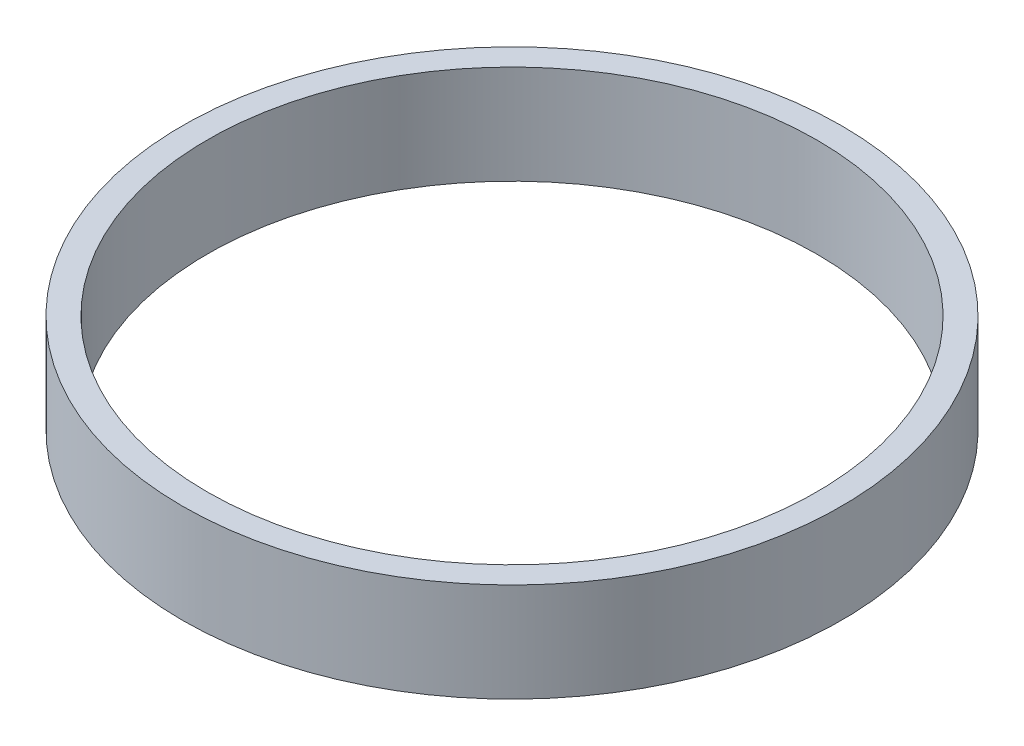
ISO-10303-21;
HEADER;
FILE_DESCRIPTION(('STEP AP214'),'2;1');
FILE_NAME('part.step','',(''),(''),'','','');
FILE_SCHEMA(('AUTOMOTIVE_DESIGN { 1 0 10303 214 1 1 1 1 }'));
ENDSEC;
DATA;
#1=APPLICATION_CONTEXT('core data for automotive mechanical design processes');
#2=APPLICATION_PROTOCOL_DEFINITION('international standard','automotive_design',2000,#1);
#3=PRODUCT_CONTEXT('',#1,'mechanical');
#4=PRODUCT('Part','Part','',(#3));
#5=PRODUCT_RELATED_PRODUCT_CATEGORY('part','',(#4));
#6=PRODUCT_DEFINITION_FORMATION('','',#4);
#7=PRODUCT_DEFINITION_CONTEXT('part definition',#1,'design');
#8=PRODUCT_DEFINITION('design','',#6,#7);
#9=PRODUCT_DEFINITION_SHAPE('','',#8);
#10=(LENGTH_UNIT() NAMED_UNIT(*) SI_UNIT(.MILLI.,.METRE.));
#11=(NAMED_UNIT(*) PLANE_ANGLE_UNIT() SI_UNIT($,.RADIAN.));
#12=(NAMED_UNIT(*) SI_UNIT($,.STERADIAN.) SOLID_ANGLE_UNIT());
#13=UNCERTAINTY_MEASURE_WITH_UNIT(LENGTH_MEASURE(1.E-05),#10,'distance_accuracy_value','');
#14=(GEOMETRIC_REPRESENTATION_CONTEXT(3) GLOBAL_UNCERTAINTY_ASSIGNED_CONTEXT((#13)) GLOBAL_UNIT_ASSIGNED_CONTEXT((#10,
#11,#12)) REPRESENTATION_CONTEXT('',''));
#15=CARTESIAN_POINT('',(0.,0.,0.));
#16=DIRECTION('',(0.,0.,1.));
#17=DIRECTION('',(1.,0.,0.));
#18=AXIS2_PLACEMENT_3D('',#15,#16,#17);
#19=CARTESIAN_POINT('',(0.,6.,0.));
#20=DIRECTION('',(0.,-1.,0.));
#21=DIRECTION('',(0.,0.,-1.));
#22=AXIS2_PLACEMENT_3D('',#19,#20,#21);
#23=CYLINDRICAL_SURFACE('',#22,20.);
#24=CARTESIAN_POINT('',(0.,6.,0.));
#25=DIRECTION('',(0.,1.,0.));
#26=DIRECTION('',(0.,0.,1.));
#27=AXIS2_PLACEMENT_3D('',#24,#25,#26);
#28=CIRCLE('',#27,20.);
#29=CARTESIAN_POINT('',(0.,6.,20.));
#30=VERTEX_POINT('',#29);
#31=EDGE_CURVE('E10',#30,#30,#28,.T.);
#32=ORIENTED_EDGE('',*,*,#31,.F.);
#33=EDGE_LOOP('',(#32));
#34=FACE_BOUND('',#33,.T.);
#35=CARTESIAN_POINT('',(0.,0.,0.));
#36=DIRECTION('',(0.,1.,0.));
#37=DIRECTION('',(0.,0.,1.));
#38=AXIS2_PLACEMENT_3D('',#35,#36,#37);
#39=CIRCLE('',#38,20.);
#40=CARTESIAN_POINT('',(0.,0.,20.));
#41=VERTEX_POINT('',#40);
#42=EDGE_CURVE('E40',#41,#41,#39,.T.);
#43=ORIENTED_EDGE('',*,*,#42,.T.);
#44=EDGE_LOOP('',(#43));
#45=FACE_BOUND('',#44,.T.);
#46=ADVANCED_FACE('F37',(#34,#45),#23,.T.);
#47=CARTESIAN_POINT('',(0.,6.,0.));
#48=DIRECTION('',(0.,1.,0.));
#49=DIRECTION('',(0.,0.,1.));
#50=AXIS2_PLACEMENT_3D('',#47,#48,#49);
#51=PLANE('',#50);
#52=CARTESIAN_POINT('',(0.,6.,0.));
#53=DIRECTION('',(0.,1.,0.));
#54=DIRECTION('',(0.,0.,1.));
#55=AXIS2_PLACEMENT_3D('',#52,#53,#54);
#56=CIRCLE('',#55,18.5);
#57=CARTESIAN_POINT('',(0.,6.,18.5));
#58=VERTEX_POINT('',#57);
#59=EDGE_CURVE('E51',#58,#58,#56,.T.);
#60=ORIENTED_EDGE('',*,*,#59,.F.);
#61=EDGE_LOOP('',(#60));
#62=FACE_BOUND('',#61,.T.);
#63=ORIENTED_EDGE('',*,*,#31,.T.);
#64=EDGE_LOOP('',(#63));
#65=FACE_BOUND('',#64,.T.);
#66=ADVANCED_FACE('F68',(#62,#65),#51,.T.);
#67=CARTESIAN_POINT('',(0.,0.,0.));
#68=DIRECTION('',(0.,1.,0.));
#69=DIRECTION('',(0.,0.,1.));
#70=AXIS2_PLACEMENT_3D('',#67,#68,#69);
#71=PLANE('',#70);
#72=CARTESIAN_POINT('',(0.,0.,0.));
#73=DIRECTION('',(0.,1.,0.));
#74=DIRECTION('',(0.,0.,1.));
#75=AXIS2_PLACEMENT_3D('',#72,#73,#74);
#76=CIRCLE('',#75,18.5);
#77=CARTESIAN_POINT('',(0.,0.,18.5));
#78=VERTEX_POINT('',#77);
#79=EDGE_CURVE('E49',#78,#78,#76,.T.);
#80=ORIENTED_EDGE('',*,*,#79,.T.);
#81=EDGE_LOOP('',(#80));
#82=FACE_BOUND('',#81,.T.);
#83=ORIENTED_EDGE('',*,*,#42,.F.);
#84=EDGE_LOOP('',(#83));
#85=FACE_BOUND('',#84,.T.);
#86=ADVANCED_FACE('F59',(#82,#85),#71,.F.);
#87=CARTESIAN_POINT('',(0.,0.,0.));
#88=DIRECTION('',(0.,1.,0.));
#89=DIRECTION('',(0.,0.,1.));
#90=AXIS2_PLACEMENT_3D('',#87,#88,#89);
#91=CYLINDRICAL_SURFACE('',#90,18.5);
#92=ORIENTED_EDGE('',*,*,#79,.F.);
#93=EDGE_LOOP('',(#92));
#94=FACE_BOUND('',#93,.T.);
#95=ORIENTED_EDGE('',*,*,#59,.T.);
#96=EDGE_LOOP('',(#95));
#97=FACE_BOUND('',#96,.T.);
#98=ADVANCED_FACE('F62',(#94,#97),#91,.F.);
#99=CLOSED_SHELL('',(#46,#66,#86,#98));
#100=MANIFOLD_SOLID_BREP('B2',#99);
#101=ADVANCED_BREP_SHAPE_REPRESENTATION('',(#18,#100),#14);
#102=SHAPE_DEFINITION_REPRESENTATION(#9,#101);
ENDSEC;
END-ISO-10303-21;
